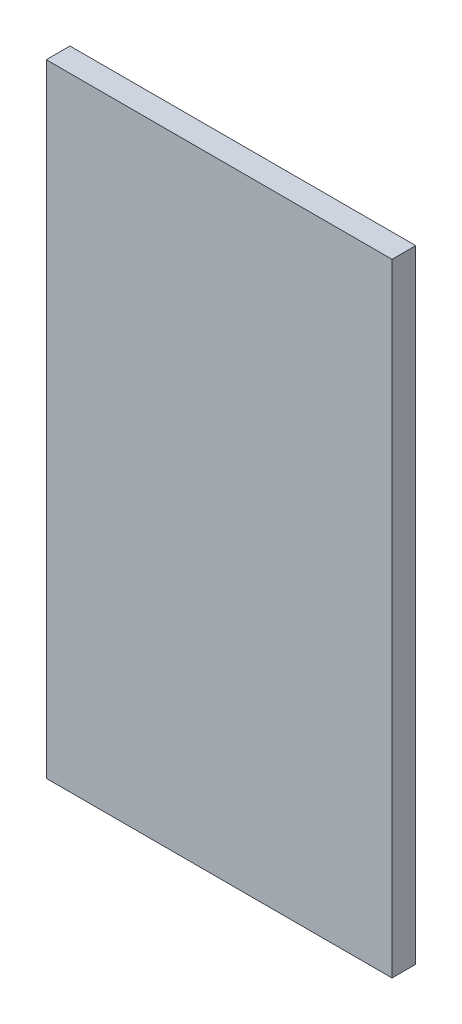
ISO-10303-21;
HEADER;
FILE_DESCRIPTION(('STEP AP214'),'2;1');
FILE_NAME('part.step','',(''),(''),'','','');
FILE_SCHEMA(('AUTOMOTIVE_DESIGN { 1 0 10303 214 1 1 1 1 }'));
ENDSEC;
DATA;
#1=APPLICATION_CONTEXT('core data for automotive mechanical design processes');
#2=APPLICATION_PROTOCOL_DEFINITION('international standard','automotive_design',2000,#1);
#3=PRODUCT_CONTEXT('',#1,'mechanical');
#4=PRODUCT('Part','Part','',(#3));
#5=PRODUCT_RELATED_PRODUCT_CATEGORY('part','',(#4));
#6=PRODUCT_DEFINITION_FORMATION('','',#4);
#7=PRODUCT_DEFINITION_CONTEXT('part definition',#1,'design');
#8=PRODUCT_DEFINITION('design','',#6,#7);
#9=PRODUCT_DEFINITION_SHAPE('','',#8);
#10=(LENGTH_UNIT() NAMED_UNIT(*) SI_UNIT(.MILLI.,.METRE.));
#11=(NAMED_UNIT(*) PLANE_ANGLE_UNIT() SI_UNIT($,.RADIAN.));
#12=(NAMED_UNIT(*) SI_UNIT($,.STERADIAN.) SOLID_ANGLE_UNIT());
#13=UNCERTAINTY_MEASURE_WITH_UNIT(LENGTH_MEASURE(1.E-05),#10,'distance_accuracy_value','');
#14=(GEOMETRIC_REPRESENTATION_CONTEXT(3) GLOBAL_UNCERTAINTY_ASSIGNED_CONTEXT((#13)) GLOBAL_UNIT_ASSIGNED_CONTEXT((#10,
#11,#12)) REPRESENTATION_CONTEXT('',''));
#15=CARTESIAN_POINT('',(0.,0.,0.));
#16=DIRECTION('',(0.,0.,1.));
#17=DIRECTION('',(1.,0.,0.));
#18=AXIS2_PLACEMENT_3D('',#15,#16,#17);
#19=CARTESIAN_POINT('',(2.60008,0.7,0.));
#20=DIRECTION('',(0.,0.,-1.));
#21=DIRECTION('',(-1.,0.,0.));
#22=AXIS2_PLACEMENT_3D('',#19,#20,#21);
#23=PLANE('',#22);
#24=DIRECTION('',(1.,0.,0.));
#25=VECTOR('',#24,1.);
#26=CARTESIAN_POINT('',(2.35008,1.15,0.));
#27=LINE('',#26,#25);
#28=CARTESIAN_POINT('',(2.35008,1.15,0.));
#29=VERTEX_POINT('',#28);
#30=CARTESIAN_POINT('',(2.85008,1.15,0.));
#31=VERTEX_POINT('',#30);
#32=EDGE_CURVE('E55',#29,#31,#27,.T.);
#33=ORIENTED_EDGE('',*,*,#32,.T.);
#34=DIRECTION('',(0.,1.,0.));
#35=VECTOR('',#34,1.);
#36=CARTESIAN_POINT('',(2.85008,1.15,0.));
#37=LINE('',#36,#35);
#38=CARTESIAN_POINT('',(2.85008,0.25,0.));
#39=VERTEX_POINT('',#38);
#40=EDGE_CURVE('E57',#31,#39,#37,.F.);
#41=ORIENTED_EDGE('',*,*,#40,.T.);
#42=DIRECTION('',(1.,0.,0.));
#43=VECTOR('',#42,1.);
#44=CARTESIAN_POINT('',(2.85008,0.25,0.));
#45=LINE('',#44,#43);
#46=CARTESIAN_POINT('',(2.35008,0.25,0.));
#47=VERTEX_POINT('',#46);
#48=EDGE_CURVE('E20',#39,#47,#45,.F.);
#49=ORIENTED_EDGE('',*,*,#48,.T.);
#50=DIRECTION('',(0.,1.,0.));
#51=VECTOR('',#50,1.);
#52=CARTESIAN_POINT('',(2.35008,0.25,0.));
#53=LINE('',#52,#51);
#54=EDGE_CURVE('E80',#47,#29,#53,.T.);
#55=ORIENTED_EDGE('',*,*,#54,.T.);
#56=EDGE_LOOP('',(#33,#41,#49,#55));
#57=FACE_BOUND('',#56,.T.);
#58=ADVANCED_FACE('F17',(#57),#23,.T.);
#59=CARTESIAN_POINT('',(2.85008,0.25,0.));
#60=DIRECTION('',(0.,1.,0.));
#61=DIRECTION('',(0.,0.,1.));
#62=AXIS2_PLACEMENT_3D('',#59,#60,#61);
#63=PLANE('',#62);
#64=DIRECTION('',(0.,0.,-1.));
#65=VECTOR('',#64,1.);
#66=CARTESIAN_POINT('',(2.35008,0.25,0.));
#67=LINE('',#66,#65);
#68=CARTESIAN_POINT('',(2.35008,0.25,0.03429));
#69=VERTEX_POINT('',#68);
#70=EDGE_CURVE('E68',#69,#47,#67,.T.);
#71=ORIENTED_EDGE('',*,*,#70,.T.);
#72=ORIENTED_EDGE('',*,*,#48,.F.);
#73=DIRECTION('',(0.,0.,1.));
#74=VECTOR('',#73,1.);
#75=CARTESIAN_POINT('',(2.85008,0.25,0.));
#76=LINE('',#75,#74);
#77=CARTESIAN_POINT('',(2.85008,0.25,0.03429));
#78=VERTEX_POINT('',#77);
#79=EDGE_CURVE('E63',#39,#78,#76,.T.);
#80=ORIENTED_EDGE('',*,*,#79,.T.);
#81=DIRECTION('',(1.,0.,0.));
#82=VECTOR('',#81,1.);
#83=CARTESIAN_POINT('',(2.60008,0.25,0.03429));
#84=LINE('',#83,#82);
#85=EDGE_CURVE('E83',#69,#78,#84,.T.);
#86=ORIENTED_EDGE('',*,*,#85,.F.);
#87=EDGE_LOOP('',(#71,#72,#80,#86));
#88=FACE_BOUND('',#87,.T.);
#89=ADVANCED_FACE('F65',(#88),#63,.F.);
#90=CARTESIAN_POINT('',(2.85008,1.15,0.));
#91=DIRECTION('',(-1.,0.,0.));
#92=DIRECTION('',(0.,0.,1.));
#93=AXIS2_PLACEMENT_3D('',#90,#91,#92);
#94=PLANE('',#93);
#95=ORIENTED_EDGE('',*,*,#79,.F.);
#96=ORIENTED_EDGE('',*,*,#40,.F.);
#97=DIRECTION('',(0.,0.,-1.));
#98=VECTOR('',#97,1.);
#99=CARTESIAN_POINT('',(2.85008,1.15,0.));
#100=LINE('',#99,#98);
#101=CARTESIAN_POINT('',(2.85008,1.15,0.03429));
#102=VERTEX_POINT('',#101);
#103=EDGE_CURVE('E75',#31,#102,#100,.F.);
#104=ORIENTED_EDGE('',*,*,#103,.T.);
#105=DIRECTION('',(0.,1.,0.));
#106=VECTOR('',#105,1.);
#107=CARTESIAN_POINT('',(2.85008,0.7,0.03429));
#108=LINE('',#107,#106);
#109=EDGE_CURVE('E72',#78,#102,#108,.T.);
#110=ORIENTED_EDGE('',*,*,#109,.F.);
#111=EDGE_LOOP('',(#95,#96,#104,#110));
#112=FACE_BOUND('',#111,.T.);
#113=ADVANCED_FACE('F70',(#112),#94,.F.);
#114=CARTESIAN_POINT('',(2.35008,1.15,0.));
#115=DIRECTION('',(0.,-1.,0.));
#116=DIRECTION('',(0.,0.,-1.));
#117=AXIS2_PLACEMENT_3D('',#114,#115,#116);
#118=PLANE('',#117);
#119=ORIENTED_EDGE('',*,*,#103,.F.);
#120=ORIENTED_EDGE('',*,*,#32,.F.);
#121=DIRECTION('',(0.,0.,-1.));
#122=VECTOR('',#121,1.);
#123=CARTESIAN_POINT('',(2.35008,1.15,0.));
#124=LINE('',#123,#122);
#125=CARTESIAN_POINT('',(2.35008,1.15,0.03429));
#126=VERTEX_POINT('',#125);
#127=EDGE_CURVE('E35',#29,#126,#124,.F.);
#128=ORIENTED_EDGE('',*,*,#127,.T.);
#129=DIRECTION('',(1.,0.,0.));
#130=VECTOR('',#129,1.);
#131=CARTESIAN_POINT('',(2.60008,1.15,0.03429));
#132=LINE('',#131,#130);
#133=EDGE_CURVE('E26',#102,#126,#132,.F.);
#134=ORIENTED_EDGE('',*,*,#133,.F.);
#135=EDGE_LOOP('',(#119,#120,#128,#134));
#136=FACE_BOUND('',#135,.T.);
#137=ADVANCED_FACE('F89',(#136),#118,.F.);
#138=CARTESIAN_POINT('',(2.35008,0.25,0.));
#139=DIRECTION('',(1.,0.,0.));
#140=DIRECTION('',(0.,0.,-1.));
#141=AXIS2_PLACEMENT_3D('',#138,#139,#140);
#142=PLANE('',#141);
#143=ORIENTED_EDGE('',*,*,#127,.F.);
#144=ORIENTED_EDGE('',*,*,#54,.F.);
#145=ORIENTED_EDGE('',*,*,#70,.F.);
#146=DIRECTION('',(0.,1.,0.));
#147=VECTOR('',#146,1.);
#148=CARTESIAN_POINT('',(2.35008,0.7,0.03429));
#149=LINE('',#148,#147);
#150=EDGE_CURVE('E11',#126,#69,#149,.F.);
#151=ORIENTED_EDGE('',*,*,#150,.F.);
#152=EDGE_LOOP('',(#143,#144,#145,#151));
#153=FACE_BOUND('',#152,.T.);
#154=ADVANCED_FACE('F91',(#153),#142,.F.);
#155=CARTESIAN_POINT('',(2.60008,0.7,0.03429));
#156=DIRECTION('',(0.,0.,1.));
#157=DIRECTION('',(1.,0.,0.));
#158=AXIS2_PLACEMENT_3D('',#155,#156,#157);
#159=PLANE('',#158);
#160=ORIENTED_EDGE('',*,*,#133,.T.);
#161=ORIENTED_EDGE('',*,*,#150,.T.);
#162=ORIENTED_EDGE('',*,*,#85,.T.);
#163=ORIENTED_EDGE('',*,*,#109,.T.);
#164=EDGE_LOOP('',(#160,#161,#162,#163));
#165=FACE_BOUND('',#164,.T.);
#166=ADVANCED_FACE('F88',(#165),#159,.T.);
#167=CLOSED_SHELL('',(#58,#89,#113,#137,#154,#166));
#168=MANIFOLD_SOLID_BREP('B1',#167);
#169=ADVANCED_BREP_SHAPE_REPRESENTATION('',(#18,#168),#14);
#170=SHAPE_DEFINITION_REPRESENTATION(#9,#169);
ENDSEC;
END-ISO-10303-21;
